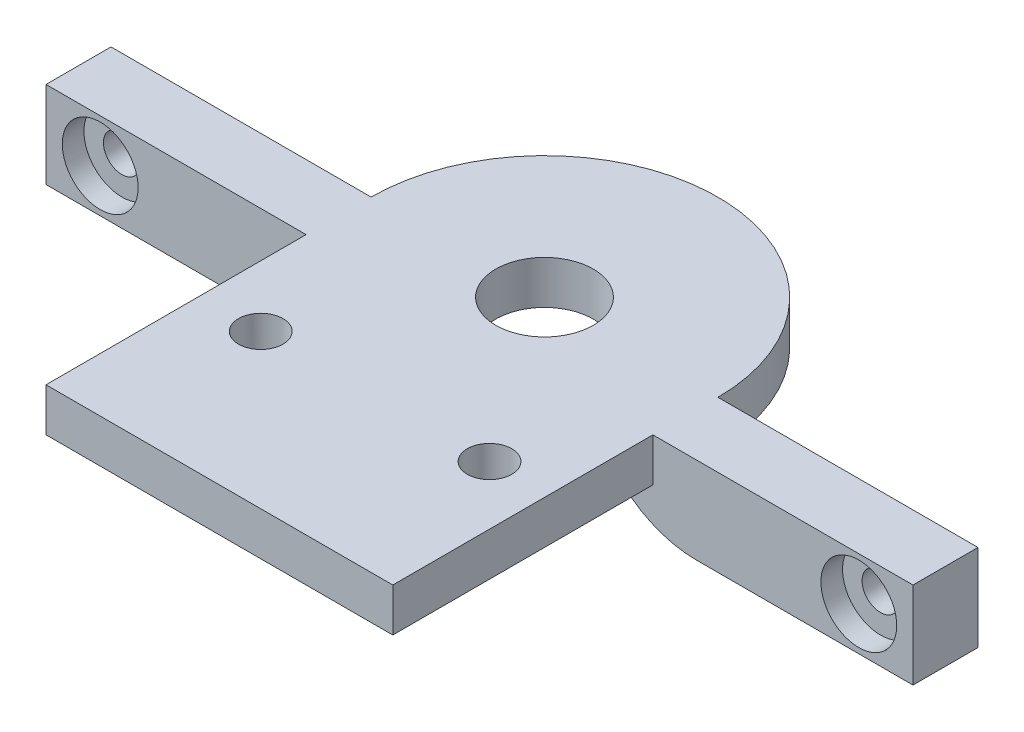
ISO-10303-21;
HEADER;
FILE_DESCRIPTION(('STEP AP214'),'2;1');
FILE_NAME('part.step','',(''),(''),'','','');
FILE_SCHEMA(('AUTOMOTIVE_DESIGN { 1 0 10303 214 1 1 1 1 }'));
ENDSEC;
DATA;
#1=APPLICATION_CONTEXT('core data for automotive mechanical design processes');
#2=APPLICATION_PROTOCOL_DEFINITION('international standard','automotive_design',2000,#1);
#3=PRODUCT_CONTEXT('',#1,'mechanical');
#4=PRODUCT('Part','Part','',(#3));
#5=PRODUCT_RELATED_PRODUCT_CATEGORY('part','',(#4));
#6=PRODUCT_DEFINITION_FORMATION('','',#4);
#7=PRODUCT_DEFINITION_CONTEXT('part definition',#1,'design');
#8=PRODUCT_DEFINITION('design','',#6,#7);
#9=PRODUCT_DEFINITION_SHAPE('','',#8);
#10=(LENGTH_UNIT() NAMED_UNIT(*) SI_UNIT(.MILLI.,.METRE.));
#11=(NAMED_UNIT(*) PLANE_ANGLE_UNIT() SI_UNIT($,.RADIAN.));
#12=(NAMED_UNIT(*) SI_UNIT($,.STERADIAN.) SOLID_ANGLE_UNIT());
#13=UNCERTAINTY_MEASURE_WITH_UNIT(LENGTH_MEASURE(1.E-05),#10,'distance_accuracy_value','');
#14=(GEOMETRIC_REPRESENTATION_CONTEXT(3) GLOBAL_UNCERTAINTY_ASSIGNED_CONTEXT((#13)) GLOBAL_UNIT_ASSIGNED_CONTEXT((#10,
#11,#12)) REPRESENTATION_CONTEXT('',''));
#15=CARTESIAN_POINT('',(0.,0.,0.));
#16=DIRECTION('',(0.,0.,1.));
#17=DIRECTION('',(1.,0.,0.));
#18=AXIS2_PLACEMENT_3D('',#15,#16,#17);
#19=CARTESIAN_POINT('',(0.,4.,0.));
#20=DIRECTION('',(0.,-1.,0.));
#21=DIRECTION('',(0.,0.,-1.));
#22=AXIS2_PLACEMENT_3D('',#19,#20,#21);
#23=PLANE('',#22);
#24=CARTESIAN_POINT('',(-10.359727728627,4.,15.8257243637918));
#25=DIRECTION('',(0.,1.,0.));
#26=DIRECTION('',(0.,0.,1.));
#27=AXIS2_PLACEMENT_3D('',#24,#25,#26);
#28=CIRCLE('',#27,2.05);
#29=CARTESIAN_POINT('',(-10.359727728627,4.,17.8757243637918));
#30=VERTEX_POINT('',#29);
#31=EDGE_CURVE('E343',#30,#30,#28,.T.);
#32=ORIENTED_EDGE('',*,*,#31,.F.);
#33=EDGE_LOOP('',(#32));
#34=FACE_BOUND('',#33,.T.);
#35=CARTESIAN_POINT('',(10.5946891672748,4.,15.6693992130785));
#36=DIRECTION('',(0.,1.,0.));
#37=DIRECTION('',(0.,0.,1.));
#38=AXIS2_PLACEMENT_3D('',#35,#36,#37);
#39=CIRCLE('',#38,2.05);
#40=CARTESIAN_POINT('',(10.5946891672748,4.,17.7193992130785));
#41=VERTEX_POINT('',#40);
#42=EDGE_CURVE('E351',#41,#41,#39,.T.);
#43=ORIENTED_EDGE('',*,*,#42,.F.);
#44=EDGE_LOOP('',(#43));
#45=FACE_BOUND('',#44,.T.);
#46=CARTESIAN_POINT('',(0.,4.,0.));
#47=DIRECTION('',(0.,1.,0.));
#48=DIRECTION('',(0.,0.,-1.));
#49=AXIS2_PLACEMENT_3D('',#46,#47,#48);
#50=CIRCLE('',#49,16.);
#51=CARTESIAN_POINT('',(16.,4.,0.));
#52=VERTEX_POINT('',#51);
#53=CARTESIAN_POINT('',(-16.,4.,0.));
#54=VERTEX_POINT('',#53);
#55=EDGE_CURVE('E224',#52,#54,#50,.T.);
#56=ORIENTED_EDGE('',*,*,#55,.T.);
#57=DIRECTION('',(-1.,0.,0.));
#58=VECTOR('',#57,1.);
#59=CARTESIAN_POINT('',(-16.,4.,0.));
#60=LINE('',#59,#58);
#61=CARTESIAN_POINT('',(-40.,4.,0.));
#62=VERTEX_POINT('',#61);
#63=EDGE_CURVE('E177',#54,#62,#60,.T.);
#64=ORIENTED_EDGE('',*,*,#63,.T.);
#65=DIRECTION('',(0.,0.,1.));
#66=VECTOR('',#65,1.);
#67=CARTESIAN_POINT('',(-40.,4.,0.));
#68=LINE('',#67,#66);
#69=CARTESIAN_POINT('',(-40.,4.,6.00000000000001));
#70=VERTEX_POINT('',#69);
#71=EDGE_CURVE('E164',#62,#70,#68,.T.);
#72=ORIENTED_EDGE('',*,*,#71,.T.);
#73=DIRECTION('',(1.,0.,0.));
#74=VECTOR('',#73,1.);
#75=CARTESIAN_POINT('',(-16.,4.,6.));
#76=LINE('',#75,#74);
#77=CARTESIAN_POINT('',(-16.,4.,6.00000000000001));
#78=VERTEX_POINT('',#77);
#79=EDGE_CURVE('E158',#70,#78,#76,.T.);
#80=ORIENTED_EDGE('',*,*,#79,.T.);
#81=DIRECTION('',(0.,0.,1.));
#82=VECTOR('',#81,1.);
#83=CARTESIAN_POINT('',(-16.,4.,0.));
#84=LINE('',#83,#82);
#85=CARTESIAN_POINT('',(-16.,4.,30.));
#86=VERTEX_POINT('',#85);
#87=EDGE_CURVE('E228',#78,#86,#84,.T.);
#88=ORIENTED_EDGE('',*,*,#87,.T.);
#89=DIRECTION('',(1.,0.,0.));
#90=VECTOR('',#89,1.);
#91=CARTESIAN_POINT('',(-16.,4.,30.));
#92=LINE('',#91,#90);
#93=CARTESIAN_POINT('',(16.,4.,30.));
#94=VERTEX_POINT('',#93);
#95=EDGE_CURVE('E232',#86,#94,#92,.T.);
#96=ORIENTED_EDGE('',*,*,#95,.T.);
#97=DIRECTION('',(0.,0.,-1.));
#98=VECTOR('',#97,1.);
#99=CARTESIAN_POINT('',(16.,4.,0.));
#100=LINE('',#99,#98);
#101=CARTESIAN_POINT('',(16.,4.,6.));
#102=VERTEX_POINT('',#101);
#103=EDGE_CURVE('E235',#94,#102,#100,.T.);
#104=ORIENTED_EDGE('',*,*,#103,.T.);
#105=DIRECTION('',(1.,0.,0.));
#106=VECTOR('',#105,1.);
#107=CARTESIAN_POINT('',(16.,4.,6.));
#108=LINE('',#107,#106);
#109=CARTESIAN_POINT('',(40.,4.,6.));
#110=VERTEX_POINT('',#109);
#111=EDGE_CURVE('E186',#102,#110,#108,.T.);
#112=ORIENTED_EDGE('',*,*,#111,.T.);
#113=DIRECTION('',(0.,0.,-1.));
#114=VECTOR('',#113,1.);
#115=CARTESIAN_POINT('',(40.,4.,0.));
#116=LINE('',#115,#114);
#117=CARTESIAN_POINT('',(40.,4.,0.));
#118=VERTEX_POINT('',#117);
#119=EDGE_CURVE('E204',#110,#118,#116,.T.);
#120=ORIENTED_EDGE('',*,*,#119,.T.);
#121=DIRECTION('',(-1.,0.,0.));
#122=VECTOR('',#121,1.);
#123=CARTESIAN_POINT('',(16.,4.,0.));
#124=LINE('',#123,#122);
#125=EDGE_CURVE('E192',#118,#52,#124,.T.);
#126=ORIENTED_EDGE('',*,*,#125,.T.);
#127=EDGE_LOOP('',(#56,#64,#72,#80,#88,#96,#104,#112,#120,#126));
#128=FACE_BOUND('',#127,.T.);
#129=CARTESIAN_POINT('',(0.,4.,0.));
#130=DIRECTION('',(0.,1.,0.));
#131=DIRECTION('',(0.,0.,1.));
#132=AXIS2_PLACEMENT_3D('',#129,#130,#131);
#133=CIRCLE('',#132,4.5);
#134=CARTESIAN_POINT('',(0.,4.,4.5));
#135=VERTEX_POINT('',#134);
#136=EDGE_CURVE('E216',#135,#135,#133,.T.);
#137=ORIENTED_EDGE('',*,*,#136,.F.);
#138=EDGE_LOOP('',(#137));
#139=FACE_BOUND('',#138,.T.);
#140=ADVANCED_FACE('F38',(#34,#45,#128,#139),#23,.F.);
#141=CARTESIAN_POINT('',(0.,0.,0.));
#142=DIRECTION('',(0.,-1.,0.));
#143=DIRECTION('',(0.,0.,-1.));
#144=AXIS2_PLACEMENT_3D('',#141,#142,#143);
#145=PLANE('',#144);
#146=CARTESIAN_POINT('',(-10.359727728627,0.,15.8257243637918));
#147=DIRECTION('',(0.,-1.,0.));
#148=DIRECTION('',(0.,0.,-1.));
#149=AXIS2_PLACEMENT_3D('',#146,#147,#148);
#150=CIRCLE('',#149,2.05);
#151=CARTESIAN_POINT('',(-10.359727728627,0.,13.7757243637918));
#152=VERTEX_POINT('',#151);
#153=EDGE_CURVE('E42',#152,#152,#150,.T.);
#154=ORIENTED_EDGE('',*,*,#153,.F.);
#155=EDGE_LOOP('',(#154));
#156=FACE_BOUND('',#155,.T.);
#157=CARTESIAN_POINT('',(10.5946891672748,0.,15.6693992130785));
#158=DIRECTION('',(0.,-1.,0.));
#159=DIRECTION('',(0.,0.,-1.));
#160=AXIS2_PLACEMENT_3D('',#157,#158,#159);
#161=CIRCLE('',#160,2.05);
#162=CARTESIAN_POINT('',(10.5946891672748,0.,13.6193992130785));
#163=VERTEX_POINT('',#162);
#164=EDGE_CURVE('E340',#163,#163,#161,.T.);
#165=ORIENTED_EDGE('',*,*,#164,.F.);
#166=EDGE_LOOP('',(#165));
#167=FACE_BOUND('',#166,.T.);
#168=CARTESIAN_POINT('',(0.,0.,0.));
#169=DIRECTION('',(0.,1.,0.));
#170=DIRECTION('',(0.,0.,-1.));
#171=AXIS2_PLACEMENT_3D('',#168,#169,#170);
#172=CIRCLE('',#171,16.);
#173=CARTESIAN_POINT('',(16.,0.,0.));
#174=VERTEX_POINT('',#173);
#175=CARTESIAN_POINT('',(-16.,0.,0.));
#176=VERTEX_POINT('',#175);
#177=EDGE_CURVE('E220',#174,#176,#172,.T.);
#178=ORIENTED_EDGE('',*,*,#177,.F.);
#179=DIRECTION('',(-1.,0.,0.));
#180=VECTOR('',#179,1.);
#181=CARTESIAN_POINT('',(16.,0.,0.));
#182=LINE('',#181,#180);
#183=CARTESIAN_POINT('',(8.,0.,0.));
#184=VERTEX_POINT('',#183);
#185=EDGE_CURVE('E303',#174,#184,#182,.T.);
#186=ORIENTED_EDGE('',*,*,#185,.T.);
#187=DIRECTION('',(0.,0.,1.));
#188=VECTOR('',#187,1.);
#189=CARTESIAN_POINT('',(8.,0.,6.));
#190=LINE('',#189,#188);
#191=CARTESIAN_POINT('',(8.,0.,6.));
#192=VERTEX_POINT('',#191);
#193=EDGE_CURVE('E299',#184,#192,#190,.T.);
#194=ORIENTED_EDGE('',*,*,#193,.T.);
#195=DIRECTION('',(1.,0.,0.));
#196=VECTOR('',#195,1.);
#197=CARTESIAN_POINT('',(16.,0.,6.));
#198=LINE('',#197,#196);
#199=CARTESIAN_POINT('',(16.,0.,6.));
#200=VERTEX_POINT('',#199);
#201=EDGE_CURVE('E296',#192,#200,#198,.T.);
#202=ORIENTED_EDGE('',*,*,#201,.T.);
#203=DIRECTION('',(0.,0.,-1.));
#204=VECTOR('',#203,1.);
#205=CARTESIAN_POINT('',(16.,0.,0.));
#206=LINE('',#205,#204);
#207=CARTESIAN_POINT('',(16.,0.,30.));
#208=VERTEX_POINT('',#207);
#209=EDGE_CURVE('E229',#208,#200,#206,.T.);
#210=ORIENTED_EDGE('',*,*,#209,.F.);
#211=DIRECTION('',(1.,0.,0.));
#212=VECTOR('',#211,1.);
#213=CARTESIAN_POINT('',(-16.,0.,30.));
#214=LINE('',#213,#212);
#215=CARTESIAN_POINT('',(-16.,0.,30.));
#216=VERTEX_POINT('',#215);
#217=EDGE_CURVE('E246',#216,#208,#214,.T.);
#218=ORIENTED_EDGE('',*,*,#217,.F.);
#219=DIRECTION('',(0.,0.,1.));
#220=VECTOR('',#219,1.);
#221=CARTESIAN_POINT('',(-16.,0.,0.));
#222=LINE('',#221,#220);
#223=CARTESIAN_POINT('',(-16.,0.,6.));
#224=VERTEX_POINT('',#223);
#225=EDGE_CURVE('E243',#224,#216,#222,.T.);
#226=ORIENTED_EDGE('',*,*,#225,.F.);
#227=DIRECTION('',(1.,0.,0.));
#228=VECTOR('',#227,1.);
#229=CARTESIAN_POINT('',(-16.,0.,6.));
#230=LINE('',#229,#228);
#231=CARTESIAN_POINT('',(-7.99999999999999,0.,6.));
#232=VERTEX_POINT('',#231);
#233=EDGE_CURVE('E292',#224,#232,#230,.T.);
#234=ORIENTED_EDGE('',*,*,#233,.T.);
#235=DIRECTION('',(0.,0.,1.));
#236=VECTOR('',#235,1.);
#237=CARTESIAN_POINT('',(-8.,0.,0.));
#238=LINE('',#237,#236);
#239=CARTESIAN_POINT('',(-8.,0.,0.));
#240=VERTEX_POINT('',#239);
#241=EDGE_CURVE('E288',#232,#240,#238,.F.);
#242=ORIENTED_EDGE('',*,*,#241,.T.);
#243=DIRECTION('',(-1.,0.,0.));
#244=VECTOR('',#243,1.);
#245=CARTESIAN_POINT('',(-16.,0.,0.));
#246=LINE('',#245,#244);
#247=EDGE_CURVE('E275',#240,#176,#246,.T.);
#248=ORIENTED_EDGE('',*,*,#247,.T.);
#249=EDGE_LOOP('',(#178,#186,#194,#202,#210,#218,#226,#234,#242,#248));
#250=FACE_BOUND('',#249,.T.);
#251=CARTESIAN_POINT('',(0.,0.,0.));
#252=DIRECTION('',(0.,1.,0.));
#253=DIRECTION('',(0.,0.,1.));
#254=AXIS2_PLACEMENT_3D('',#251,#252,#253);
#255=CIRCLE('',#254,4.5);
#256=CARTESIAN_POINT('',(0.,0.,4.5));
#257=VERTEX_POINT('',#256);
#258=EDGE_CURVE('E213',#257,#257,#255,.T.);
#259=ORIENTED_EDGE('',*,*,#258,.T.);
#260=EDGE_LOOP('',(#259));
#261=FACE_BOUND('',#260,.T.);
#262=ADVANCED_FACE('F437',(#156,#167,#250,#261),#145,.T.);
#263=CARTESIAN_POINT('',(0.,4.,0.));
#264=DIRECTION('',(0.,-1.,0.));
#265=DIRECTION('',(0.,0.,-1.));
#266=AXIS2_PLACEMENT_3D('',#263,#264,#265);
#267=CYLINDRICAL_SURFACE('',#266,16.);
#268=ORIENTED_EDGE('',*,*,#177,.T.);
#269=DIRECTION('',(0.,-1.,0.));
#270=VECTOR('',#269,1.);
#271=CARTESIAN_POINT('',(-16.,4.,0.));
#272=LINE('',#271,#270);
#273=EDGE_CURVE('E263',#54,#176,#272,.T.);
#274=ORIENTED_EDGE('',*,*,#273,.F.);
#275=ORIENTED_EDGE('',*,*,#55,.F.);
#276=DIRECTION('',(0.,-1.,0.));
#277=VECTOR('',#276,1.);
#278=CARTESIAN_POINT('',(16.,4.,0.));
#279=LINE('',#278,#277);
#280=EDGE_CURVE('E239',#52,#174,#279,.T.);
#281=ORIENTED_EDGE('',*,*,#280,.T.);
#282=EDGE_LOOP('',(#268,#274,#275,#281));
#283=FACE_BOUND('',#282,.T.);
#284=ADVANCED_FACE('F443',(#283),#267,.T.);
#285=CARTESIAN_POINT('',(-16.,4.,0.));
#286=DIRECTION('',(1.,0.,0.));
#287=DIRECTION('',(0.,0.,-1.));
#288=AXIS2_PLACEMENT_3D('',#285,#286,#287);
#289=PLANE('',#288);
#290=ORIENTED_EDGE('',*,*,#87,.F.);
#291=DIRECTION('',(0.,-1.,0.));
#292=VECTOR('',#291,1.);
#293=CARTESIAN_POINT('',(-16.,4.,6.));
#294=LINE('',#293,#292);
#295=EDGE_CURVE('E271',#78,#224,#294,.T.);
#296=ORIENTED_EDGE('',*,*,#295,.T.);
#297=ORIENTED_EDGE('',*,*,#225,.T.);
#298=DIRECTION('',(0.,-1.,0.));
#299=VECTOR('',#298,1.);
#300=CARTESIAN_POINT('',(-16.,4.,30.));
#301=LINE('',#300,#299);
#302=EDGE_CURVE('E259',#86,#216,#301,.T.);
#303=ORIENTED_EDGE('',*,*,#302,.F.);
#304=EDGE_LOOP('',(#290,#296,#297,#303));
#305=FACE_BOUND('',#304,.T.);
#306=ADVANCED_FACE('F457',(#305),#289,.F.);
#307=CARTESIAN_POINT('',(-16.,4.,30.));
#308=DIRECTION('',(0.,0.,-1.));
#309=DIRECTION('',(-1.,0.,0.));
#310=AXIS2_PLACEMENT_3D('',#307,#308,#309);
#311=PLANE('',#310);
#312=ORIENTED_EDGE('',*,*,#217,.T.);
#313=DIRECTION('',(0.,-1.,0.));
#314=VECTOR('',#313,1.);
#315=CARTESIAN_POINT('',(16.,4.,30.));
#316=LINE('',#315,#314);
#317=EDGE_CURVE('E255',#94,#208,#316,.T.);
#318=ORIENTED_EDGE('',*,*,#317,.F.);
#319=ORIENTED_EDGE('',*,*,#95,.F.);
#320=ORIENTED_EDGE('',*,*,#302,.T.);
#321=EDGE_LOOP('',(#312,#318,#319,#320));
#322=FACE_BOUND('',#321,.T.);
#323=ADVANCED_FACE('F433',(#322),#311,.F.);
#324=CARTESIAN_POINT('',(16.,4.,0.));
#325=DIRECTION('',(-1.,0.,0.));
#326=DIRECTION('',(0.,0.,1.));
#327=AXIS2_PLACEMENT_3D('',#324,#325,#326);
#328=PLANE('',#327);
#329=ORIENTED_EDGE('',*,*,#209,.T.);
#330=DIRECTION('',(0.,1.,0.));
#331=VECTOR('',#330,1.);
#332=CARTESIAN_POINT('',(16.,4.,6.));
#333=LINE('',#332,#331);
#334=EDGE_CURVE('E267',#200,#102,#333,.T.);
#335=ORIENTED_EDGE('',*,*,#334,.T.);
#336=ORIENTED_EDGE('',*,*,#103,.F.);
#337=ORIENTED_EDGE('',*,*,#317,.T.);
#338=EDGE_LOOP('',(#329,#335,#336,#337));
#339=FACE_BOUND('',#338,.T.);
#340=ADVANCED_FACE('F425',(#339),#328,.F.);
#341=CARTESIAN_POINT('',(0.,4.,0.));
#342=DIRECTION('',(0.,-1.,0.));
#343=DIRECTION('',(0.,0.,-1.));
#344=AXIS2_PLACEMENT_3D('',#341,#342,#343);
#345=CYLINDRICAL_SURFACE('',#344,4.5);
#346=ORIENTED_EDGE('',*,*,#136,.T.);
#347=EDGE_LOOP('',(#346));
#348=FACE_BOUND('',#347,.T.);
#349=ORIENTED_EDGE('',*,*,#258,.F.);
#350=EDGE_LOOP('',(#349));
#351=FACE_BOUND('',#350,.T.);
#352=ADVANCED_FACE('F478',(#348,#351),#345,.F.);
#353=CARTESIAN_POINT('',(16.,-4.,0.));
#354=DIRECTION('',(0.,0.,-1.));
#355=DIRECTION('',(-1.,0.,0.));
#356=AXIS2_PLACEMENT_3D('',#353,#354,#355);
#357=PLANE('',#356);
#358=CARTESIAN_POINT('',(35.,0.,0.));
#359=DIRECTION('',(0.,0.,-1.));
#360=DIRECTION('',(-1.,0.,0.));
#361=AXIS2_PLACEMENT_3D('',#358,#359,#360);
#362=CIRCLE('',#361,1.7);
#363=CARTESIAN_POINT('',(33.3,0.,0.));
#364=VERTEX_POINT('',#363);
#365=EDGE_CURVE('E180',#364,#364,#362,.T.);
#366=ORIENTED_EDGE('',*,*,#365,.F.);
#367=EDGE_LOOP('',(#366));
#368=FACE_BOUND('',#367,.T.);
#369=DIRECTION('',(-1.,0.,0.));
#370=VECTOR('',#369,1.);
#371=CARTESIAN_POINT('',(16.,-4.,0.));
#372=LINE('',#371,#370);
#373=CARTESIAN_POINT('',(40.,-4.,0.));
#374=VERTEX_POINT('',#373);
#375=CARTESIAN_POINT('',(20.,-4.,0.));
#376=VERTEX_POINT('',#375);
#377=EDGE_CURVE('E196',#374,#376,#372,.T.);
#378=ORIENTED_EDGE('',*,*,#377,.T.);
#379=CARTESIAN_POINT('',(20.,6.,0.));
#380=DIRECTION('',(0.,0.,-1.));
#381=DIRECTION('',(-1.,0.,0.));
#382=AXIS2_PLACEMENT_3D('',#379,#380,#381);
#383=CIRCLE('',#382,10.);
#384=CARTESIAN_POINT('',(14.,-2.,0.));
#385=VERTEX_POINT('',#384);
#386=EDGE_CURVE('E330',#376,#385,#383,.T.);
#387=ORIENTED_EDGE('',*,*,#386,.T.);
#388=CARTESIAN_POINT('',(8.,-10.,0.));
#389=DIRECTION('',(0.,0.,-1.));
#390=DIRECTION('',(-1.,0.,0.));
#391=AXIS2_PLACEMENT_3D('',#388,#389,#390);
#392=CIRCLE('',#391,10.);
#393=EDGE_CURVE('E307',#385,#184,#392,.F.);
#394=ORIENTED_EDGE('',*,*,#393,.T.);
#395=ORIENTED_EDGE('',*,*,#185,.F.);
#396=ORIENTED_EDGE('',*,*,#280,.F.);
#397=ORIENTED_EDGE('',*,*,#125,.F.);
#398=DIRECTION('',(0.,1.,0.));
#399=VECTOR('',#398,1.);
#400=CARTESIAN_POINT('',(40.,-4.,0.));
#401=LINE('',#400,#399);
#402=EDGE_CURVE('E210',#374,#118,#401,.T.);
#403=ORIENTED_EDGE('',*,*,#402,.F.);
#404=EDGE_LOOP('',(#378,#387,#394,#395,#396,#397,#403));
#405=FACE_BOUND('',#404,.T.);
#406=ADVANCED_FACE('F416',(#368,#405),#357,.T.);
#407=CARTESIAN_POINT('',(40.,-4.,0.));
#408=DIRECTION('',(1.,0.,0.));
#409=DIRECTION('',(0.,0.,-1.));
#410=AXIS2_PLACEMENT_3D('',#407,#408,#409);
#411=PLANE('',#410);
#412=ORIENTED_EDGE('',*,*,#119,.F.);
#413=DIRECTION('',(0.,1.,0.));
#414=VECTOR('',#413,1.);
#415=CARTESIAN_POINT('',(40.,-4.,6.));
#416=LINE('',#415,#414);
#417=CARTESIAN_POINT('',(40.,-4.,6.));
#418=VERTEX_POINT('',#417);
#419=EDGE_CURVE('E200',#418,#110,#416,.T.);
#420=ORIENTED_EDGE('',*,*,#419,.F.);
#421=DIRECTION('',(0.,0.,-1.));
#422=VECTOR('',#421,1.);
#423=CARTESIAN_POINT('',(40.,-4.,0.));
#424=LINE('',#423,#422);
#425=EDGE_CURVE('E191',#418,#374,#424,.T.);
#426=ORIENTED_EDGE('',*,*,#425,.T.);
#427=ORIENTED_EDGE('',*,*,#402,.T.);
#428=EDGE_LOOP('',(#412,#420,#426,#427));
#429=FACE_BOUND('',#428,.T.);
#430=ADVANCED_FACE('F398',(#429),#411,.T.);
#431=CARTESIAN_POINT('',(16.,-4.,6.));
#432=DIRECTION('',(0.,0.,1.));
#433=DIRECTION('',(1.,0.,0.));
#434=AXIS2_PLACEMENT_3D('',#431,#432,#433);
#435=PLANE('',#434);
#436=CARTESIAN_POINT('',(35.,0.,6.00000000000001));
#437=DIRECTION('',(0.,0.,1.));
#438=DIRECTION('',(1.,0.,0.));
#439=AXIS2_PLACEMENT_3D('',#436,#437,#438);
#440=CIRCLE('',#439,3.5);
#441=CARTESIAN_POINT('',(38.5,0.,6.00000000000001));
#442=VERTEX_POINT('',#441);
#443=EDGE_CURVE('E284',#442,#442,#440,.T.);
#444=ORIENTED_EDGE('',*,*,#443,.F.);
#445=EDGE_LOOP('',(#444));
#446=FACE_BOUND('',#445,.T.);
#447=CARTESIAN_POINT('',(8.,-10.,6.));
#448=DIRECTION('',(0.,0.,1.));
#449=DIRECTION('',(1.,0.,0.));
#450=AXIS2_PLACEMENT_3D('',#447,#448,#449);
#451=CIRCLE('',#450,10.);
#452=CARTESIAN_POINT('',(14.,-2.,6.));
#453=VERTEX_POINT('',#452);
#454=EDGE_CURVE('E310',#192,#453,#451,.F.);
#455=ORIENTED_EDGE('',*,*,#454,.T.);
#456=CARTESIAN_POINT('',(20.,6.,6.));
#457=DIRECTION('',(0.,0.,1.));
#458=DIRECTION('',(1.,0.,0.));
#459=AXIS2_PLACEMENT_3D('',#456,#457,#458);
#460=CIRCLE('',#459,10.);
#461=CARTESIAN_POINT('',(20.,-4.,6.));
#462=VERTEX_POINT('',#461);
#463=EDGE_CURVE('E324',#453,#462,#460,.T.);
#464=ORIENTED_EDGE('',*,*,#463,.T.);
#465=DIRECTION('',(1.,0.,0.));
#466=VECTOR('',#465,1.);
#467=CARTESIAN_POINT('',(16.,-4.,6.));
#468=LINE('',#467,#466);
#469=EDGE_CURVE('E188',#462,#418,#468,.T.);
#470=ORIENTED_EDGE('',*,*,#469,.T.);
#471=ORIENTED_EDGE('',*,*,#419,.T.);
#472=ORIENTED_EDGE('',*,*,#111,.F.);
#473=ORIENTED_EDGE('',*,*,#334,.F.);
#474=ORIENTED_EDGE('',*,*,#201,.F.);
#475=EDGE_LOOP('',(#455,#464,#470,#471,#472,#473,#474));
#476=FACE_BOUND('',#475,.T.);
#477=ADVANCED_FACE('F394',(#446,#476),#435,.T.);
#478=CARTESIAN_POINT('',(0.,-4.,0.));
#479=DIRECTION('',(0.,1.,0.));
#480=DIRECTION('',(0.,0.,1.));
#481=AXIS2_PLACEMENT_3D('',#478,#479,#480);
#482=PLANE('',#481);
#483=ORIENTED_EDGE('',*,*,#469,.F.);
#484=DIRECTION('',(0.,0.,-1.));
#485=VECTOR('',#484,1.);
#486=CARTESIAN_POINT('',(20.,-4.,0.));
#487=LINE('',#486,#485);
#488=EDGE_CURVE('E327',#462,#376,#487,.T.);
#489=ORIENTED_EDGE('',*,*,#488,.T.);
#490=ORIENTED_EDGE('',*,*,#377,.F.);
#491=ORIENTED_EDGE('',*,*,#425,.F.);
#492=EDGE_LOOP('',(#483,#489,#490,#491));
#493=FACE_BOUND('',#492,.T.);
#494=ADVANCED_FACE('F397',(#493),#482,.F.);
#495=CARTESIAN_POINT('',(-16.,-4.,6.));
#496=DIRECTION('',(0.,0.,1.));
#497=DIRECTION('',(1.,0.,0.));
#498=AXIS2_PLACEMENT_3D('',#495,#496,#497);
#499=PLANE('',#498);
#500=CARTESIAN_POINT('',(-35.,0.,6.00000000000001));
#501=DIRECTION('',(0.,0.,1.));
#502=DIRECTION('',(1.,0.,0.));
#503=AXIS2_PLACEMENT_3D('',#500,#501,#502);
#504=CIRCLE('',#503,3.5);
#505=CARTESIAN_POINT('',(-31.5,0.,6.00000000000001));
#506=VERTEX_POINT('',#505);
#507=EDGE_CURVE('E349',#506,#506,#504,.T.);
#508=ORIENTED_EDGE('',*,*,#507,.F.);
#509=EDGE_LOOP('',(#508));
#510=FACE_BOUND('',#509,.T.);
#511=DIRECTION('',(1.,0.,0.));
#512=VECTOR('',#511,1.);
#513=CARTESIAN_POINT('',(-16.,-4.,6.));
#514=LINE('',#513,#512);
#515=CARTESIAN_POINT('',(-40.,-4.,6.00000000000001));
#516=VERTEX_POINT('',#515);
#517=CARTESIAN_POINT('',(-20.,-4.,6.00000000000001));
#518=VERTEX_POINT('',#517);
#519=EDGE_CURVE('E168',#516,#518,#514,.T.);
#520=ORIENTED_EDGE('',*,*,#519,.T.);
#521=CARTESIAN_POINT('',(-20.,6.,6.00000000000001));
#522=DIRECTION('',(0.,0.,1.));
#523=DIRECTION('',(1.,0.,0.));
#524=AXIS2_PLACEMENT_3D('',#521,#522,#523);
#525=CIRCLE('',#524,10.);
#526=CARTESIAN_POINT('',(-14.,-2.,6.));
#527=VERTEX_POINT('',#526);
#528=EDGE_CURVE('E11',#518,#527,#525,.T.);
#529=ORIENTED_EDGE('',*,*,#528,.T.);
#530=CARTESIAN_POINT('',(-7.99999999999999,-10.,6.));
#531=DIRECTION('',(0.,0.,1.));
#532=DIRECTION('',(1.,0.,0.));
#533=AXIS2_PLACEMENT_3D('',#530,#531,#532);
#534=CIRCLE('',#533,10.);
#535=EDGE_CURVE('E314',#527,#232,#534,.F.);
#536=ORIENTED_EDGE('',*,*,#535,.T.);
#537=ORIENTED_EDGE('',*,*,#233,.F.);
#538=ORIENTED_EDGE('',*,*,#295,.F.);
#539=ORIENTED_EDGE('',*,*,#79,.F.);
#540=DIRECTION('',(0.,1.,0.));
#541=VECTOR('',#540,1.);
#542=CARTESIAN_POINT('',(-40.,-4.,6.00000000000001));
#543=LINE('',#542,#541);
#544=EDGE_CURVE('E167',#516,#70,#543,.T.);
#545=ORIENTED_EDGE('',*,*,#544,.F.);
#546=EDGE_LOOP('',(#520,#529,#536,#537,#538,#539,#545));
#547=FACE_BOUND('',#546,.T.);
#548=ADVANCED_FACE('F454',(#510,#547),#499,.T.);
#549=CARTESIAN_POINT('',(-40.,-4.,0.));
#550=DIRECTION('',(-1.,0.,0.));
#551=DIRECTION('',(0.,0.,1.));
#552=AXIS2_PLACEMENT_3D('',#549,#550,#551);
#553=PLANE('',#552);
#554=ORIENTED_EDGE('',*,*,#71,.F.);
#555=DIRECTION('',(0.,1.,0.));
#556=VECTOR('',#555,1.);
#557=CARTESIAN_POINT('',(-40.,-4.,0.));
#558=LINE('',#557,#556);
#559=CARTESIAN_POINT('',(-40.,-4.,0.));
#560=VERTEX_POINT('',#559);
#561=EDGE_CURVE('E153',#560,#62,#558,.T.);
#562=ORIENTED_EDGE('',*,*,#561,.F.);
#563=DIRECTION('',(0.,0.,1.));
#564=VECTOR('',#563,1.);
#565=CARTESIAN_POINT('',(-40.,-4.,0.));
#566=LINE('',#565,#564);
#567=EDGE_CURVE('E157',#560,#516,#566,.T.);
#568=ORIENTED_EDGE('',*,*,#567,.T.);
#569=ORIENTED_EDGE('',*,*,#544,.T.);
#570=EDGE_LOOP('',(#554,#562,#568,#569));
#571=FACE_BOUND('',#570,.T.);
#572=ADVANCED_FACE('F162',(#571),#553,.T.);
#573=CARTESIAN_POINT('',(-16.,-4.,0.));
#574=DIRECTION('',(0.,0.,-1.));
#575=DIRECTION('',(-1.,0.,0.));
#576=AXIS2_PLACEMENT_3D('',#573,#574,#575);
#577=PLANE('',#576);
#578=CARTESIAN_POINT('',(-35.,0.,0.));
#579=DIRECTION('',(0.,0.,-1.));
#580=DIRECTION('',(-1.,0.,0.));
#581=AXIS2_PLACEMENT_3D('',#578,#579,#580);
#582=CIRCLE('',#581,1.7);
#583=CARTESIAN_POINT('',(-36.7,0.,0.));
#584=VERTEX_POINT('',#583);
#585=EDGE_CURVE('E280',#584,#584,#582,.T.);
#586=ORIENTED_EDGE('',*,*,#585,.F.);
#587=EDGE_LOOP('',(#586));
#588=FACE_BOUND('',#587,.T.);
#589=CARTESIAN_POINT('',(-8.,-10.,0.));
#590=DIRECTION('',(0.,0.,-1.));
#591=DIRECTION('',(-1.,0.,0.));
#592=AXIS2_PLACEMENT_3D('',#589,#590,#591);
#593=CIRCLE('',#592,10.);
#594=CARTESIAN_POINT('',(-14.,-2.,0.));
#595=VERTEX_POINT('',#594);
#596=EDGE_CURVE('E317',#240,#595,#593,.F.);
#597=ORIENTED_EDGE('',*,*,#596,.T.);
#598=CARTESIAN_POINT('',(-20.,6.,0.));
#599=DIRECTION('',(0.,0.,-1.));
#600=DIRECTION('',(-1.,0.,0.));
#601=AXIS2_PLACEMENT_3D('',#598,#599,#600);
#602=CIRCLE('',#601,10.);
#603=CARTESIAN_POINT('',(-20.,-4.,0.));
#604=VERTEX_POINT('',#603);
#605=EDGE_CURVE('E63',#595,#604,#602,.T.);
#606=ORIENTED_EDGE('',*,*,#605,.T.);
#607=DIRECTION('',(-1.,0.,0.));
#608=VECTOR('',#607,1.);
#609=CARTESIAN_POINT('',(-16.,-4.,0.));
#610=LINE('',#609,#608);
#611=EDGE_CURVE('E150',#604,#560,#610,.T.);
#612=ORIENTED_EDGE('',*,*,#611,.T.);
#613=ORIENTED_EDGE('',*,*,#561,.T.);
#614=ORIENTED_EDGE('',*,*,#63,.F.);
#615=ORIENTED_EDGE('',*,*,#273,.T.);
#616=ORIENTED_EDGE('',*,*,#247,.F.);
#617=EDGE_LOOP('',(#597,#606,#612,#613,#614,#615,#616));
#618=FACE_BOUND('',#617,.T.);
#619=ADVANCED_FACE('F152',(#588,#618),#577,.T.);
#620=CARTESIAN_POINT('',(0.,-4.,0.));
#621=DIRECTION('',(0.,-1.,0.));
#622=DIRECTION('',(0.,0.,-1.));
#623=AXIS2_PLACEMENT_3D('',#620,#621,#622);
#624=PLANE('',#623);
#625=ORIENTED_EDGE('',*,*,#611,.F.);
#626=DIRECTION('',(0.,0.,1.));
#627=VECTOR('',#626,1.);
#628=CARTESIAN_POINT('',(-20.,-4.,6.00000000000001));
#629=LINE('',#628,#627);
#630=EDGE_CURVE('E48',#604,#518,#629,.T.);
#631=ORIENTED_EDGE('',*,*,#630,.T.);
#632=ORIENTED_EDGE('',*,*,#519,.F.);
#633=ORIENTED_EDGE('',*,*,#567,.F.);
#634=EDGE_LOOP('',(#625,#631,#632,#633));
#635=FACE_BOUND('',#634,.T.);
#636=ADVANCED_FACE('F170',(#635),#624,.T.);
#637=CARTESIAN_POINT('',(35.,0.,6.00000000000001));
#638=DIRECTION('',(0.,0.,1.));
#639=DIRECTION('',(1.,0.,0.));
#640=AXIS2_PLACEMENT_3D('',#637,#638,#639);
#641=CYLINDRICAL_SURFACE('',#640,1.7);
#642=ORIENTED_EDGE('',*,*,#365,.T.);
#643=EDGE_LOOP('',(#642));
#644=FACE_BOUND('',#643,.T.);
#645=CARTESIAN_POINT('',(35.,0.,4.00000000000001));
#646=DIRECTION('',(0.,0.,1.));
#647=DIRECTION('',(1.,0.,0.));
#648=AXIS2_PLACEMENT_3D('',#645,#646,#647);
#649=CIRCLE('',#648,1.7);
#650=CARTESIAN_POINT('',(36.7,0.,4.00000000000001));
#651=VERTEX_POINT('',#650);
#652=EDGE_CURVE('E279',#651,#651,#649,.T.);
#653=ORIENTED_EDGE('',*,*,#652,.T.);
#654=EDGE_LOOP('',(#653));
#655=FACE_BOUND('',#654,.T.);
#656=ADVANCED_FACE('F379',(#644,#655),#641,.F.);
#657=CARTESIAN_POINT('',(36.7,0.,4.00000000000001));
#658=DIRECTION('',(0.,0.,-1.));
#659=DIRECTION('',(-1.,0.,0.));
#660=AXIS2_PLACEMENT_3D('',#657,#658,#659);
#661=PLANE('',#660);
#662=ORIENTED_EDGE('',*,*,#652,.F.);
#663=EDGE_LOOP('',(#662));
#664=FACE_BOUND('',#663,.T.);
#665=CARTESIAN_POINT('',(35.,0.,4.00000000000001));
#666=DIRECTION('',(0.,0.,1.));
#667=DIRECTION('',(1.,0.,0.));
#668=AXIS2_PLACEMENT_3D('',#665,#666,#667);
#669=CIRCLE('',#668,3.5);
#670=CARTESIAN_POINT('',(38.5,0.,4.00000000000001));
#671=VERTEX_POINT('',#670);
#672=EDGE_CURVE('E372',#671,#671,#669,.T.);
#673=ORIENTED_EDGE('',*,*,#672,.T.);
#674=EDGE_LOOP('',(#673));
#675=FACE_BOUND('',#674,.T.);
#676=ADVANCED_FACE('F381',(#664,#675),#661,.F.);
#677=CARTESIAN_POINT('',(35.,0.,6.00000000000001));
#678=DIRECTION('',(0.,0.,1.));
#679=DIRECTION('',(1.,0.,0.));
#680=AXIS2_PLACEMENT_3D('',#677,#678,#679);
#681=CYLINDRICAL_SURFACE('',#680,3.5);
#682=ORIENTED_EDGE('',*,*,#672,.F.);
#683=EDGE_LOOP('',(#682));
#684=FACE_BOUND('',#683,.T.);
#685=ORIENTED_EDGE('',*,*,#443,.T.);
#686=EDGE_LOOP('',(#685));
#687=FACE_BOUND('',#686,.T.);
#688=ADVANCED_FACE('F384',(#684,#687),#681,.F.);
#689=CARTESIAN_POINT('',(-35.,0.,6.00000000000001));
#690=DIRECTION('',(0.,0.,1.));
#691=DIRECTION('',(1.,0.,0.));
#692=AXIS2_PLACEMENT_3D('',#689,#690,#691);
#693=CYLINDRICAL_SURFACE('',#692,1.7);
#694=ORIENTED_EDGE('',*,*,#585,.T.);
#695=EDGE_LOOP('',(#694));
#696=FACE_BOUND('',#695,.T.);
#697=CARTESIAN_POINT('',(-35.,0.,4.00000000000001));
#698=DIRECTION('',(0.,0.,1.));
#699=DIRECTION('',(1.,0.,0.));
#700=AXIS2_PLACEMENT_3D('',#697,#698,#699);
#701=CIRCLE('',#700,1.7);
#702=CARTESIAN_POINT('',(-33.3,0.,4.00000000000001));
#703=VERTEX_POINT('',#702);
#704=EDGE_CURVE('E285',#703,#703,#701,.T.);
#705=ORIENTED_EDGE('',*,*,#704,.T.);
#706=EDGE_LOOP('',(#705));
#707=FACE_BOUND('',#706,.T.);
#708=ADVANCED_FACE('F390',(#696,#707),#693,.F.);
#709=CARTESIAN_POINT('',(-33.3,0.,4.00000000000001));
#710=DIRECTION('',(0.,0.,-1.));
#711=DIRECTION('',(-1.,0.,0.));
#712=AXIS2_PLACEMENT_3D('',#709,#710,#711);
#713=PLANE('',#712);
#714=ORIENTED_EDGE('',*,*,#704,.F.);
#715=EDGE_LOOP('',(#714));
#716=FACE_BOUND('',#715,.T.);
#717=CARTESIAN_POINT('',(-35.,0.,4.00000000000001));
#718=DIRECTION('',(0.,0.,1.));
#719=DIRECTION('',(1.,0.,0.));
#720=AXIS2_PLACEMENT_3D('',#717,#718,#719);
#721=CIRCLE('',#720,3.5);
#722=CARTESIAN_POINT('',(-31.5,0.,4.00000000000001));
#723=VERTEX_POINT('',#722);
#724=EDGE_CURVE('E362',#723,#723,#721,.T.);
#725=ORIENTED_EDGE('',*,*,#724,.T.);
#726=EDGE_LOOP('',(#725));
#727=FACE_BOUND('',#726,.T.);
#728=ADVANCED_FACE('F516',(#716,#727),#713,.F.);
#729=CARTESIAN_POINT('',(-35.,0.,6.00000000000001));
#730=DIRECTION('',(0.,0.,1.));
#731=DIRECTION('',(1.,0.,0.));
#732=AXIS2_PLACEMENT_3D('',#729,#730,#731);
#733=CYLINDRICAL_SURFACE('',#732,3.5);
#734=ORIENTED_EDGE('',*,*,#724,.F.);
#735=EDGE_LOOP('',(#734));
#736=FACE_BOUND('',#735,.T.);
#737=ORIENTED_EDGE('',*,*,#507,.T.);
#738=EDGE_LOOP('',(#737));
#739=FACE_BOUND('',#738,.T.);
#740=ADVANCED_FACE('F520',(#736,#739),#733,.F.);
#741=CARTESIAN_POINT('',(8.,-10.,0.));
#742=DIRECTION('',(0.,0.,-1.));
#743=DIRECTION('',(-1.,0.,0.));
#744=AXIS2_PLACEMENT_3D('',#741,#742,#743);
#745=CYLINDRICAL_SURFACE('',#744,10.);
#746=ORIENTED_EDGE('',*,*,#393,.F.);
#747=DIRECTION('',(0.,0.,-1.));
#748=VECTOR('',#747,1.);
#749=CARTESIAN_POINT('',(14.,-2.,0.));
#750=LINE('',#749,#748);
#751=EDGE_CURVE('E320',#385,#453,#750,.F.);
#752=ORIENTED_EDGE('',*,*,#751,.T.);
#753=ORIENTED_EDGE('',*,*,#454,.F.);
#754=ORIENTED_EDGE('',*,*,#193,.F.);
#755=EDGE_LOOP('',(#746,#752,#753,#754));
#756=FACE_BOUND('',#755,.T.);
#757=ADVANCED_FACE('F406',(#756),#745,.F.);
#758=CARTESIAN_POINT('',(-8.,-10.,0.));
#759=DIRECTION('',(0.,0.,-1.));
#760=DIRECTION('',(-1.,0.,0.));
#761=AXIS2_PLACEMENT_3D('',#758,#759,#760);
#762=CYLINDRICAL_SURFACE('',#761,10.);
#763=ORIENTED_EDGE('',*,*,#535,.F.);
#764=DIRECTION('',(0.,0.,-1.));
#765=VECTOR('',#764,1.);
#766=CARTESIAN_POINT('',(-14.,-2.,0.));
#767=LINE('',#766,#765);
#768=EDGE_CURVE('E333',#527,#595,#767,.T.);
#769=ORIENTED_EDGE('',*,*,#768,.T.);
#770=ORIENTED_EDGE('',*,*,#596,.F.);
#771=ORIENTED_EDGE('',*,*,#241,.F.);
#772=EDGE_LOOP('',(#763,#769,#770,#771));
#773=FACE_BOUND('',#772,.T.);
#774=ADVANCED_FACE('F449',(#773),#762,.F.);
#775=CARTESIAN_POINT('',(20.,6.,0.));
#776=DIRECTION('',(0.,0.,-1.));
#777=DIRECTION('',(-1.,0.,0.));
#778=AXIS2_PLACEMENT_3D('',#775,#776,#777);
#779=CYLINDRICAL_SURFACE('',#778,10.);
#780=ORIENTED_EDGE('',*,*,#386,.F.);
#781=ORIENTED_EDGE('',*,*,#488,.F.);
#782=ORIENTED_EDGE('',*,*,#463,.F.);
#783=ORIENTED_EDGE('',*,*,#751,.F.);
#784=EDGE_LOOP('',(#780,#781,#782,#783));
#785=FACE_BOUND('',#784,.T.);
#786=ADVANCED_FACE('F410',(#785),#779,.T.);
#787=CARTESIAN_POINT('',(-20.,6.,0.));
#788=DIRECTION('',(0.,0.,-1.));
#789=DIRECTION('',(-1.,0.,0.));
#790=AXIS2_PLACEMENT_3D('',#787,#788,#789);
#791=CYLINDRICAL_SURFACE('',#790,10.);
#792=ORIENTED_EDGE('',*,*,#528,.F.);
#793=ORIENTED_EDGE('',*,*,#630,.F.);
#794=ORIENTED_EDGE('',*,*,#605,.F.);
#795=ORIENTED_EDGE('',*,*,#768,.F.);
#796=EDGE_LOOP('',(#792,#793,#794,#795));
#797=FACE_BOUND('',#796,.T.);
#798=ADVANCED_FACE('F40',(#797),#791,.T.);
#799=CARTESIAN_POINT('',(10.5946891672748,-4.,15.6693992130785));
#800=DIRECTION('',(0.,1.,0.));
#801=DIRECTION('',(0.,0.,1.));
#802=AXIS2_PLACEMENT_3D('',#799,#800,#801);
#803=CYLINDRICAL_SURFACE('',#802,2.05);
#804=ORIENTED_EDGE('',*,*,#164,.T.);
#805=EDGE_LOOP('',(#804));
#806=FACE_BOUND('',#805,.T.);
#807=ORIENTED_EDGE('',*,*,#42,.T.);
#808=EDGE_LOOP('',(#807));
#809=FACE_BOUND('',#808,.T.);
#810=ADVANCED_FACE('F525',(#806,#809),#803,.F.);
#811=CARTESIAN_POINT('',(-10.359727728627,-4.,15.8257243637918));
#812=DIRECTION('',(0.,1.,0.));
#813=DIRECTION('',(0.,0.,1.));
#814=AXIS2_PLACEMENT_3D('',#811,#812,#813);
#815=CYLINDRICAL_SURFACE('',#814,2.05);
#816=ORIENTED_EDGE('',*,*,#153,.T.);
#817=EDGE_LOOP('',(#816));
#818=FACE_BOUND('',#817,.T.);
#819=ORIENTED_EDGE('',*,*,#31,.T.);
#820=EDGE_LOOP('',(#819));
#821=FACE_BOUND('',#820,.T.);
#822=ADVANCED_FACE('F528',(#818,#821),#815,.F.);
#823=CLOSED_SHELL('',(#140,#262,#284,#306,#323,#340,#352,#406,#430,#477,#494,#548,#572,#619,
#636,#656,#676,#688,#708,#728,#740,#757,#774,#786,#798,#810,#822));
#824=MANIFOLD_SOLID_BREP('B2',#823);
#825=ADVANCED_BREP_SHAPE_REPRESENTATION('',(#18,#824),#14);
#826=SHAPE_DEFINITION_REPRESENTATION(#9,#825);
ENDSEC;
END-ISO-10303-21;
